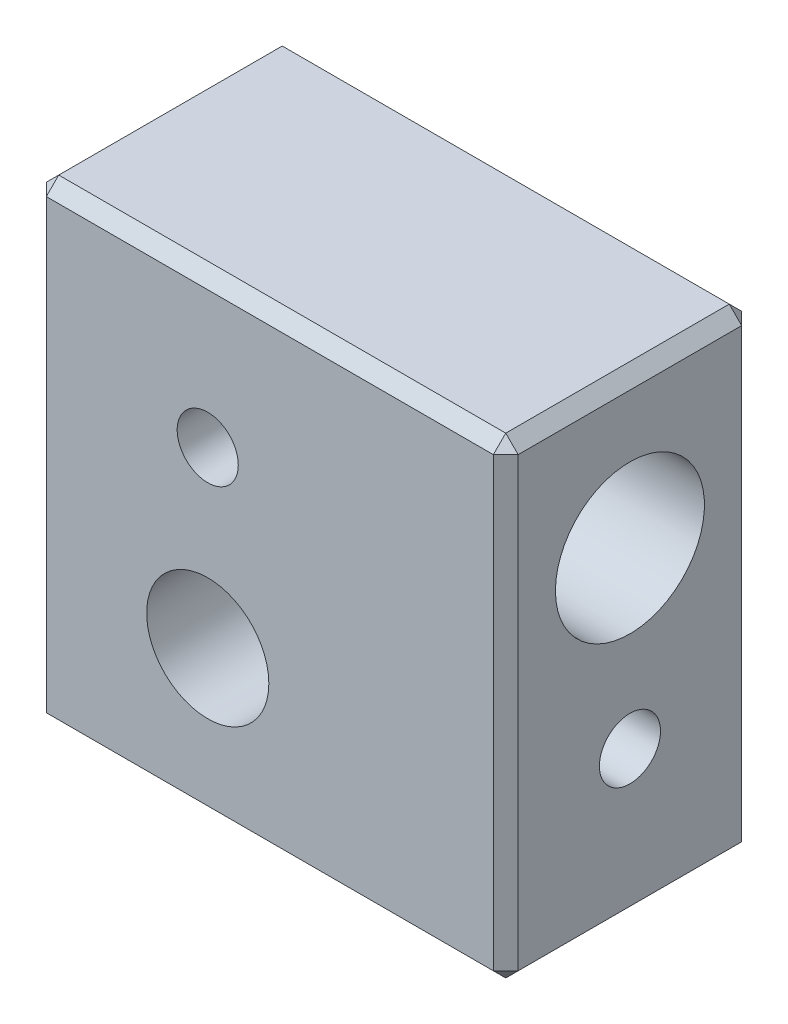
ISO-10303-21;
HEADER;
FILE_DESCRIPTION(('STEP AP214'),'2;1');
FILE_NAME('part.step','',(''),(''),'','','');
FILE_SCHEMA(('AUTOMOTIVE_DESIGN { 1 0 10303 214 1 1 1 1 }'));
ENDSEC;
DATA;
#1=APPLICATION_CONTEXT('core data for automotive mechanical design processes');
#2=APPLICATION_PROTOCOL_DEFINITION('international standard','automotive_design',2000,#1);
#3=PRODUCT_CONTEXT('',#1,'mechanical');
#4=PRODUCT('Part','Part','',(#3));
#5=PRODUCT_RELATED_PRODUCT_CATEGORY('part','',(#4));
#6=PRODUCT_DEFINITION_FORMATION('','',#4);
#7=PRODUCT_DEFINITION_CONTEXT('part definition',#1,'design');
#8=PRODUCT_DEFINITION('design','',#6,#7);
#9=PRODUCT_DEFINITION_SHAPE('','',#8);
#10=(LENGTH_UNIT() NAMED_UNIT(*) SI_UNIT(.MILLI.,.METRE.));
#11=(NAMED_UNIT(*) PLANE_ANGLE_UNIT() SI_UNIT($,.RADIAN.));
#12=(NAMED_UNIT(*) SI_UNIT($,.STERADIAN.) SOLID_ANGLE_UNIT());
#13=UNCERTAINTY_MEASURE_WITH_UNIT(LENGTH_MEASURE(1.E-05),#10,'distance_accuracy_value','');
#14=(GEOMETRIC_REPRESENTATION_CONTEXT(3) GLOBAL_UNCERTAINTY_ASSIGNED_CONTEXT((#13)) GLOBAL_UNIT_ASSIGNED_CONTEXT((#10,
#11,#12)) REPRESENTATION_CONTEXT('',''));
#15=CARTESIAN_POINT('',(0.,0.,0.));
#16=DIRECTION('',(0.,0.,1.));
#17=DIRECTION('',(1.,0.,0.));
#18=AXIS2_PLACEMENT_3D('',#15,#16,#17);
#19=CARTESIAN_POINT('',(-7.2166088223,-4.3152643177,133.88));
#20=DIRECTION('',(0.,0.707106781186548,-0.707106781186548));
#21=DIRECTION('',(0.,0.707106781186548,0.707106781186548));
#22=AXIS2_PLACEMENT_3D('',#19,#20,#21);
#23=PLANE('',#22);
#24=DIRECTION('',(0.,0.707106781186548,0.707106781186548));
#25=VECTOR('',#24,1.);
#26=CARTESIAN_POINT('',(11.2833911777,-4.3152643177,133.88));
#27=LINE('',#26,#25);
#28=CARTESIAN_POINT('',(11.2833911777,-4.0652643177,134.13));
#29=VERTEX_POINT('',#28);
#30=CARTESIAN_POINT('',(11.2833911777,-4.5652643177,133.63));
#31=VERTEX_POINT('',#30);
#32=EDGE_CURVE('E161',#29,#31,#27,.F.);
#33=ORIENTED_EDGE('',*,*,#32,.T.);
#34=DIRECTION('',(1.,0.,0.));
#35=VECTOR('',#34,1.);
#36=CARTESIAN_POINT('',(-7.2166088223,-4.5652643177,133.63));
#37=LINE('',#36,#35);
#38=CARTESIAN_POINT('',(-6.7166088223,-4.5652643177,133.63));
#39=VERTEX_POINT('',#38);
#40=EDGE_CURVE('E144',#31,#39,#37,.F.);
#41=ORIENTED_EDGE('',*,*,#40,.T.);
#42=DIRECTION('',(0.,-0.707106781186547,-0.707106781186548));
#43=VECTOR('',#42,1.);
#44=CARTESIAN_POINT('',(-6.7166088223,-4.0652643177,134.13));
#45=LINE('',#44,#43);
#46=CARTESIAN_POINT('',(-6.7166088223,-4.0652643177,134.13));
#47=VERTEX_POINT('',#46);
#48=EDGE_CURVE('E154',#47,#39,#45,.T.);
#49=ORIENTED_EDGE('',*,*,#48,.F.);
#50=DIRECTION('',(1.,0.,0.));
#51=VECTOR('',#50,1.);
#52=CARTESIAN_POINT('',(-7.2166088223,-4.0652643177,134.13));
#53=LINE('',#52,#51);
#54=EDGE_CURVE('E121',#47,#29,#53,.T.);
#55=ORIENTED_EDGE('',*,*,#54,.T.);
#56=EDGE_LOOP('',(#33,#41,#49,#55));
#57=FACE_BOUND('',#56,.T.);
#58=ADVANCED_FACE('F16',(#57),#23,.T.);
#59=CARTESIAN_POINT('',(-7.2166088223,-22.8152643177,133.88));
#60=DIRECTION('',(0.,0.707106781186548,0.707106781186548));
#61=DIRECTION('',(0.,-0.707106781186548,0.707106781186548));
#62=AXIS2_PLACEMENT_3D('',#59,#60,#61);
#63=PLANE('',#62);
#64=DIRECTION('',(1.,0.,0.));
#65=VECTOR('',#64,1.);
#66=CARTESIAN_POINT('',(-7.2166088223,-22.5652643177,133.63));
#67=LINE('',#66,#65);
#68=CARTESIAN_POINT('',(-6.7166088223,-22.5652643177,133.63));
#69=VERTEX_POINT('',#68);
#70=CARTESIAN_POINT('',(11.2833911777,-22.5652643177,133.63));
#71=VERTEX_POINT('',#70);
#72=EDGE_CURVE('E141',#69,#71,#67,.T.);
#73=ORIENTED_EDGE('',*,*,#72,.T.);
#74=DIRECTION('',(0.,-0.707106781186548,0.707106781186548));
#75=VECTOR('',#74,1.);
#76=CARTESIAN_POINT('',(11.2833911777,-22.8152643177,133.88));
#77=LINE('',#76,#75);
#78=CARTESIAN_POINT('',(11.2833911777,-23.0652643177,134.13));
#79=VERTEX_POINT('',#78);
#80=EDGE_CURVE('E159',#79,#71,#77,.F.);
#81=ORIENTED_EDGE('',*,*,#80,.F.);
#82=DIRECTION('',(1.,0.,0.));
#83=VECTOR('',#82,1.);
#84=CARTESIAN_POINT('',(-7.2166088223,-23.0652643177,134.13));
#85=LINE('',#84,#83);
#86=CARTESIAN_POINT('',(-6.7166088223,-23.0652643177,134.13));
#87=VERTEX_POINT('',#86);
#88=EDGE_CURVE('E150',#87,#79,#85,.T.);
#89=ORIENTED_EDGE('',*,*,#88,.F.);
#90=DIRECTION('',(0.,0.707106781186547,-0.707106781186547));
#91=VECTOR('',#90,1.);
#92=CARTESIAN_POINT('',(-6.7166088223,-23.0652643177,134.13));
#93=LINE('',#92,#91);
#94=EDGE_CURVE('E156',#87,#69,#93,.T.);
#95=ORIENTED_EDGE('',*,*,#94,.T.);
#96=EDGE_LOOP('',(#73,#81,#89,#95));
#97=FACE_BOUND('',#96,.T.);
#98=ADVANCED_FACE('F398',(#97),#63,.F.);
#99=CARTESIAN_POINT('',(-6.7166088223,-4.5652643177,143.63));
#100=DIRECTION('',(0.577350269189626,-0.577350269189626,-0.577350269189626));
#101=DIRECTION('',(-0.707106781186547,0.,-0.707106781186547));
#102=AXIS2_PLACEMENT_3D('',#99,#100,#101);
#103=PLANE('',#102);
#104=DIRECTION('',(-0.707106781186548,0.,-0.707106781186548));
#105=VECTOR('',#104,1.);
#106=CARTESIAN_POINT('',(-6.9666088223,-4.5652643177,143.38));
#107=LINE('',#106,#105);
#108=CARTESIAN_POINT('',(-7.2166088223,-4.5652643177,143.13));
#109=VERTEX_POINT('',#108);
#110=CARTESIAN_POINT('',(-6.7166088223,-4.5652643177,143.63));
#111=VERTEX_POINT('',#110);
#112=EDGE_CURVE('E139',#109,#111,#107,.F.);
#113=ORIENTED_EDGE('',*,*,#112,.T.);
#114=DIRECTION('',(0.,0.707106781186548,-0.707106781186548));
#115=VECTOR('',#114,1.);
#116=CARTESIAN_POINT('',(-6.7166088223,-4.3152643177,143.38));
#117=LINE('',#116,#115);
#118=CARTESIAN_POINT('',(-6.7166088223,-4.0652643177,143.13));
#119=VERTEX_POINT('',#118);
#120=EDGE_CURVE('E111',#111,#119,#117,.T.);
#121=ORIENTED_EDGE('',*,*,#120,.T.);
#122=DIRECTION('',(-0.707106781186548,-0.707106781186548,0.));
#123=VECTOR('',#122,1.);
#124=CARTESIAN_POINT('',(-6.9666088223,-4.3152643177,143.13));
#125=LINE('',#124,#123);
#126=EDGE_CURVE('E126',#109,#119,#125,.F.);
#127=ORIENTED_EDGE('',*,*,#126,.F.);
#128=EDGE_LOOP('',(#113,#121,#127));
#129=FACE_BOUND('',#128,.T.);
#130=ADVANCED_FACE('F138',(#129),#103,.F.);
#131=CARTESIAN_POINT('',(-6.7166088223,-22.5652643177,143.63));
#132=DIRECTION('',(0.577350269189626,0.577350269189626,-0.577350269189626));
#133=DIRECTION('',(-0.707106781186547,0.,-0.707106781186547));
#134=AXIS2_PLACEMENT_3D('',#131,#132,#133);
#135=PLANE('',#134);
#136=DIRECTION('',(0.,-0.707106781186548,-0.707106781186548));
#137=VECTOR('',#136,1.);
#138=CARTESIAN_POINT('',(-6.7166088223,-22.8152643177,143.38));
#139=LINE('',#138,#137);
#140=CARTESIAN_POINT('',(-6.7166088223,-22.5652643177,143.63));
#141=VERTEX_POINT('',#140);
#142=CARTESIAN_POINT('',(-6.7166088223,-23.0652643177,143.13));
#143=VERTEX_POINT('',#142);
#144=EDGE_CURVE('E259',#141,#143,#139,.T.);
#145=ORIENTED_EDGE('',*,*,#144,.F.);
#146=DIRECTION('',(-0.707106781186548,0.,-0.707106781186548));
#147=VECTOR('',#146,1.);
#148=CARTESIAN_POINT('',(-6.9666088223,-22.5652643177,143.38));
#149=LINE('',#148,#147);
#150=CARTESIAN_POINT('',(-7.2166088223,-22.5652643177,143.13));
#151=VERTEX_POINT('',#150);
#152=EDGE_CURVE('E125',#141,#151,#149,.T.);
#153=ORIENTED_EDGE('',*,*,#152,.T.);
#154=DIRECTION('',(-0.707106781186548,0.707106781186548,0.));
#155=VECTOR('',#154,1.);
#156=CARTESIAN_POINT('',(-6.9666088223,-22.8152643177,143.13));
#157=LINE('',#156,#155);
#158=EDGE_CURVE('E249',#151,#143,#157,.F.);
#159=ORIENTED_EDGE('',*,*,#158,.T.);
#160=EDGE_LOOP('',(#145,#153,#159));
#161=FACE_BOUND('',#160,.T.);
#162=ADVANCED_FACE('F286',(#161),#135,.F.);
#163=CARTESIAN_POINT('',(-6.7166088223,-23.0652643177,134.13));
#164=DIRECTION('',(0.577350269189626,0.577350269189626,0.577350269189626));
#165=DIRECTION('',(0.707106781186548,0.,-0.707106781186547));
#166=AXIS2_PLACEMENT_3D('',#163,#164,#165);
#167=PLANE('',#166);
#168=ORIENTED_EDGE('',*,*,#94,.F.);
#169=DIRECTION('',(-0.707106781186548,0.707106781186548,0.));
#170=VECTOR('',#169,1.);
#171=CARTESIAN_POINT('',(-6.9666088223,-22.8152643177,134.13));
#172=LINE('',#171,#170);
#173=CARTESIAN_POINT('',(-7.2166088223,-22.5652643177,134.13));
#174=VERTEX_POINT('',#173);
#175=EDGE_CURVE('E252',#87,#174,#172,.T.);
#176=ORIENTED_EDGE('',*,*,#175,.T.);
#177=DIRECTION('',(-0.707106781186548,0.,0.707106781186548));
#178=VECTOR('',#177,1.);
#179=CARTESIAN_POINT('',(-6.9666088223,-22.5652643177,133.88));
#180=LINE('',#179,#178);
#181=EDGE_CURVE('E241',#69,#174,#180,.T.);
#182=ORIENTED_EDGE('',*,*,#181,.F.);
#183=EDGE_LOOP('',(#168,#176,#182));
#184=FACE_BOUND('',#183,.T.);
#185=ADVANCED_FACE('F390',(#184),#167,.F.);
#186=CARTESIAN_POINT('',(-6.7166088223,-4.5652643177,133.63));
#187=DIRECTION('',(-0.577350269189626,0.577350269189626,-0.577350269189626));
#188=DIRECTION('',(-0.707106781186547,0.,0.707106781186547));
#189=AXIS2_PLACEMENT_3D('',#186,#187,#188);
#190=PLANE('',#189);
#191=DIRECTION('',(-0.707106781186548,0.,0.707106781186548));
#192=VECTOR('',#191,1.);
#193=CARTESIAN_POINT('',(-6.9666088223,-4.5652643177,133.88));
#194=LINE('',#193,#192);
#195=CARTESIAN_POINT('',(-7.2166088223,-4.5652643177,134.13));
#196=VERTEX_POINT('',#195);
#197=EDGE_CURVE('E238',#196,#39,#194,.F.);
#198=ORIENTED_EDGE('',*,*,#197,.F.);
#199=DIRECTION('',(-0.707106781186548,-0.707106781186548,0.));
#200=VECTOR('',#199,1.);
#201=CARTESIAN_POINT('',(-6.9666088223,-4.3152643177,134.13));
#202=LINE('',#201,#200);
#203=EDGE_CURVE('E136',#47,#196,#202,.T.);
#204=ORIENTED_EDGE('',*,*,#203,.F.);
#205=ORIENTED_EDGE('',*,*,#48,.T.);
#206=EDGE_LOOP('',(#198,#204,#205));
#207=FACE_BOUND('',#206,.T.);
#208=ADVANCED_FACE('F387',(#207),#190,.T.);
#209=CARTESIAN_POINT('',(-7.2166088223,-4.0652643177,133.63));
#210=DIRECTION('',(0.,-1.,0.));
#211=DIRECTION('',(1.,0.,0.));
#212=AXIS2_PLACEMENT_3D('',#209,#210,#211);
#213=PLANE('',#212);
#214=DIRECTION('',(0.,0.,1.));
#215=VECTOR('',#214,1.);
#216=CARTESIAN_POINT('',(11.2833911777,-4.0652643177,133.63));
#217=LINE('',#216,#215);
#218=CARTESIAN_POINT('',(11.2833911777,-4.0652643177,143.13));
#219=VERTEX_POINT('',#218);
#220=EDGE_CURVE('E232',#219,#29,#217,.F.);
#221=ORIENTED_EDGE('',*,*,#220,.T.);
#222=ORIENTED_EDGE('',*,*,#54,.F.);
#223=DIRECTION('',(0.,0.,1.));
#224=VECTOR('',#223,1.);
#225=CARTESIAN_POINT('',(-6.7166088223,-4.0652643177,133.63));
#226=LINE('',#225,#224);
#227=EDGE_CURVE('E117',#119,#47,#226,.F.);
#228=ORIENTED_EDGE('',*,*,#227,.F.);
#229=DIRECTION('',(1.,0.,0.));
#230=VECTOR('',#229,1.);
#231=CARTESIAN_POINT('',(-7.2166088223,-4.0652643177,143.13));
#232=LINE('',#231,#230);
#233=EDGE_CURVE('E107',#119,#219,#232,.T.);
#234=ORIENTED_EDGE('',*,*,#233,.T.);
#235=EDGE_LOOP('',(#221,#222,#228,#234));
#236=FACE_BOUND('',#235,.T.);
#237=ADVANCED_FACE('F119',(#236),#213,.F.);
#238=CARTESIAN_POINT('',(11.7833911777,-4.5652643177,143.13));
#239=DIRECTION('',(-0.577350269189626,-0.577350269189626,-0.577350269189626));
#240=DIRECTION('',(0.,0.707106781186547,-0.707106781186548));
#241=AXIS2_PLACEMENT_3D('',#238,#239,#240);
#242=PLANE('',#241);
#243=DIRECTION('',(0.707106781186548,0.,-0.707106781186548));
#244=VECTOR('',#243,1.);
#245=CARTESIAN_POINT('',(11.5333911777,-4.5652643177,143.38));
#246=LINE('',#245,#244);
#247=CARTESIAN_POINT('',(11.7833911777,-4.5652643177,143.13));
#248=VERTEX_POINT('',#247);
#249=CARTESIAN_POINT('',(11.2833911777,-4.5652643177,143.63));
#250=VERTEX_POINT('',#249);
#251=EDGE_CURVE('E230',#248,#250,#246,.F.);
#252=ORIENTED_EDGE('',*,*,#251,.F.);
#253=DIRECTION('',(0.707106781186548,-0.707106781186548,0.));
#254=VECTOR('',#253,1.);
#255=CARTESIAN_POINT('',(11.5333911777,-4.3152643177,143.13));
#256=LINE('',#255,#254);
#257=EDGE_CURVE('E234',#248,#219,#256,.F.);
#258=ORIENTED_EDGE('',*,*,#257,.T.);
#259=DIRECTION('',(0.,0.707106781186548,-0.707106781186548));
#260=VECTOR('',#259,1.);
#261=CARTESIAN_POINT('',(11.2833911777,-4.3152643177,143.38));
#262=LINE('',#261,#260);
#263=EDGE_CURVE('E104',#219,#250,#262,.F.);
#264=ORIENTED_EDGE('',*,*,#263,.T.);
#265=EDGE_LOOP('',(#252,#258,#264));
#266=FACE_BOUND('',#265,.T.);
#267=ADVANCED_FACE('F267',(#266),#242,.F.);
#268=CARTESIAN_POINT('',(11.2833911777,-23.0652643177,143.13));
#269=DIRECTION('',(0.577350269189626,-0.577350269189626,0.577350269189626));
#270=DIRECTION('',(0.707106781186547,0.,-0.707106781186548));
#271=AXIS2_PLACEMENT_3D('',#268,#269,#270);
#272=PLANE('',#271);
#273=DIRECTION('',(0.707106781186548,0.707106781186548,0.));
#274=VECTOR('',#273,1.);
#275=CARTESIAN_POINT('',(11.5333911777,-22.8152643177,143.13));
#276=LINE('',#275,#274);
#277=CARTESIAN_POINT('',(11.7833911777,-22.5652643177,143.13));
#278=VERTEX_POINT('',#277);
#279=CARTESIAN_POINT('',(11.2833911777,-23.0652643177,143.13));
#280=VERTEX_POINT('',#279);
#281=EDGE_CURVE('E224',#278,#280,#276,.F.);
#282=ORIENTED_EDGE('',*,*,#281,.F.);
#283=DIRECTION('',(0.707106781186548,0.,-0.707106781186548));
#284=VECTOR('',#283,1.);
#285=CARTESIAN_POINT('',(11.5333911777,-22.5652643177,143.38));
#286=LINE('',#285,#284);
#287=CARTESIAN_POINT('',(11.2833911777,-22.5652643177,143.63));
#288=VERTEX_POINT('',#287);
#289=EDGE_CURVE('E228',#288,#278,#286,.T.);
#290=ORIENTED_EDGE('',*,*,#289,.F.);
#291=DIRECTION('',(0.,-0.707106781186548,-0.707106781186548));
#292=VECTOR('',#291,1.);
#293=CARTESIAN_POINT('',(11.2833911777,-22.8152643177,143.38));
#294=LINE('',#293,#292);
#295=EDGE_CURVE('E261',#280,#288,#294,.F.);
#296=ORIENTED_EDGE('',*,*,#295,.F.);
#297=EDGE_LOOP('',(#282,#290,#296));
#298=FACE_BOUND('',#297,.T.);
#299=ADVANCED_FACE('F296',(#298),#272,.T.);
#300=CARTESIAN_POINT('',(-7.2166088223,-23.0652643177,133.63));
#301=DIRECTION('',(0.,-1.,0.));
#302=DIRECTION('',(1.,0.,0.));
#303=AXIS2_PLACEMENT_3D('',#300,#301,#302);
#304=PLANE('',#303);
#305=DIRECTION('',(0.,0.,1.));
#306=VECTOR('',#305,1.);
#307=CARTESIAN_POINT('',(11.2833911777,-23.0652643177,133.63));
#308=LINE('',#307,#306);
#309=EDGE_CURVE('E222',#280,#79,#308,.F.);
#310=ORIENTED_EDGE('',*,*,#309,.F.);
#311=DIRECTION('',(1.,0.,0.));
#312=VECTOR('',#311,1.);
#313=CARTESIAN_POINT('',(-7.2166088223,-23.0652643177,143.13));
#314=LINE('',#313,#312);
#315=EDGE_CURVE('E263',#143,#280,#314,.T.);
#316=ORIENTED_EDGE('',*,*,#315,.F.);
#317=DIRECTION('',(0.,0.,1.));
#318=VECTOR('',#317,1.);
#319=CARTESIAN_POINT('',(-6.7166088223,-23.0652643177,133.63));
#320=LINE('',#319,#318);
#321=EDGE_CURVE('E246',#143,#87,#320,.F.);
#322=ORIENTED_EDGE('',*,*,#321,.T.);
#323=ORIENTED_EDGE('',*,*,#88,.T.);
#324=EDGE_LOOP('',(#310,#316,#322,#323));
#325=FACE_BOUND('',#324,.T.);
#326=ADVANCED_FACE('F328',(#325),#304,.T.);
#327=CARTESIAN_POINT('',(-7.2166088223,-4.0652643177,133.63));
#328=DIRECTION('',(0.,0.,1.));
#329=DIRECTION('',(1.,0.,0.));
#330=AXIS2_PLACEMENT_3D('',#327,#328,#329);
#331=PLANE('',#330);
#332=CARTESIAN_POINT('',(-0.2166088223,-17.0652643177,133.63));
#333=DIRECTION('',(0.,0.,1.));
#334=DIRECTION('',(1.,0.,0.));
#335=AXIS2_PLACEMENT_3D('',#332,#333,#334);
#336=CIRCLE('',#335,2.46);
#337=CARTESIAN_POINT('',(2.2433911777,-17.0652643177,133.63));
#338=VERTEX_POINT('',#337);
#339=EDGE_CURVE('E19',#338,#338,#336,.T.);
#340=ORIENTED_EDGE('',*,*,#339,.T.);
#341=EDGE_LOOP('',(#340));
#342=FACE_BOUND('',#341,.T.);
#343=ORIENTED_EDGE('',*,*,#72,.F.);
#344=DIRECTION('',(0.,1.,0.));
#345=VECTOR('',#344,1.);
#346=CARTESIAN_POINT('',(-6.7166088223,-4.0652643177,133.63));
#347=LINE('',#346,#345);
#348=EDGE_CURVE('E243',#39,#69,#347,.F.);
#349=ORIENTED_EDGE('',*,*,#348,.F.);
#350=ORIENTED_EDGE('',*,*,#40,.F.);
#351=DIRECTION('',(0.,1.,0.));
#352=VECTOR('',#351,1.);
#353=CARTESIAN_POINT('',(11.2833911777,-4.0652643177,133.63));
#354=LINE('',#353,#352);
#355=EDGE_CURVE('E216',#31,#71,#354,.F.);
#356=ORIENTED_EDGE('',*,*,#355,.T.);
#357=EDGE_LOOP('',(#343,#349,#350,#356));
#358=FACE_BOUND('',#357,.T.);
#359=ADVANCED_FACE('F374',(#342,#358),#331,.F.);
#360=CARTESIAN_POINT('',(11.2833911777,-23.0652643177,134.13));
#361=DIRECTION('',(0.577350269189626,-0.577350269189626,-0.577350269189626));
#362=DIRECTION('',(-0.707106781186547,0.,-0.707106781186548));
#363=AXIS2_PLACEMENT_3D('',#360,#361,#362);
#364=PLANE('',#363);
#365=ORIENTED_EDGE('',*,*,#80,.T.);
#366=DIRECTION('',(0.707106781186548,0.,0.707106781186548));
#367=VECTOR('',#366,1.);
#368=CARTESIAN_POINT('',(11.5333911777,-22.5652643177,133.88));
#369=LINE('',#368,#367);
#370=CARTESIAN_POINT('',(11.7833911777,-22.5652643177,134.13));
#371=VERTEX_POINT('',#370);
#372=EDGE_CURVE('E211',#71,#371,#369,.T.);
#373=ORIENTED_EDGE('',*,*,#372,.T.);
#374=DIRECTION('',(0.707106781186548,0.707106781186548,0.));
#375=VECTOR('',#374,1.);
#376=CARTESIAN_POINT('',(11.5333911777,-22.8152643177,134.13));
#377=LINE('',#376,#375);
#378=EDGE_CURVE('E34',#79,#371,#377,.T.);
#379=ORIENTED_EDGE('',*,*,#378,.F.);
#380=EDGE_LOOP('',(#365,#373,#379));
#381=FACE_BOUND('',#380,.T.);
#382=ADVANCED_FACE('F371',(#381),#364,.T.);
#383=CARTESIAN_POINT('',(11.2833911777,-4.5652643177,133.63));
#384=DIRECTION('',(-0.577350269189626,-0.577350269189626,0.577350269189626));
#385=DIRECTION('',(0.707106781186547,0.,0.707106781186547));
#386=AXIS2_PLACEMENT_3D('',#383,#384,#385);
#387=PLANE('',#386);
#388=DIRECTION('',(0.707106781186548,0.,0.707106781186548));
#389=VECTOR('',#388,1.);
#390=CARTESIAN_POINT('',(11.5333911777,-4.5652643177,133.88));
#391=LINE('',#390,#389);
#392=CARTESIAN_POINT('',(11.7833911777,-4.5652643177,134.13));
#393=VERTEX_POINT('',#392);
#394=EDGE_CURVE('E205',#393,#31,#391,.F.);
#395=ORIENTED_EDGE('',*,*,#394,.T.);
#396=ORIENTED_EDGE('',*,*,#32,.F.);
#397=DIRECTION('',(0.707106781186548,-0.707106781186548,0.));
#398=VECTOR('',#397,1.);
#399=CARTESIAN_POINT('',(11.5333911777,-4.3152643177,134.13));
#400=LINE('',#399,#398);
#401=EDGE_CURVE('E236',#29,#393,#400,.T.);
#402=ORIENTED_EDGE('',*,*,#401,.T.);
#403=EDGE_LOOP('',(#395,#396,#402));
#404=FACE_BOUND('',#403,.T.);
#405=ADVANCED_FACE('F368',(#404),#387,.F.);
#406=CARTESIAN_POINT('',(4.7833911777,-15.8352643177,138.63));
#407=DIRECTION('',(-1.,0.,0.));
#408=DIRECTION('',(0.,0.,1.));
#409=AXIS2_PLACEMENT_3D('',#406,#407,#408);
#410=PLANE('',#409);
#411=CARTESIAN_POINT('',(4.7833911777,-17.0652643177,138.63));
#412=DIRECTION('',(1.,0.,0.));
#413=DIRECTION('',(0.,0.,-1.));
#414=AXIS2_PLACEMENT_3D('',#411,#412,#413);
#415=CIRCLE('',#414,1.23);
#416=CARTESIAN_POINT('',(4.7833911777,-17.0652643177,137.4));
#417=VERTEX_POINT('',#416);
#418=EDGE_CURVE('E202',#417,#417,#415,.T.);
#419=ORIENTED_EDGE('',*,*,#418,.T.);
#420=EDGE_LOOP('',(#419));
#421=FACE_BOUND('',#420,.T.);
#422=ADVANCED_FACE('F365',(#421),#410,.F.);
#423=CARTESIAN_POINT('',(-7.2166088223,-4.3152643177,143.38));
#424=DIRECTION('',(0.,-0.707106781186548,-0.707106781186548));
#425=DIRECTION('',(0.,0.707106781186548,-0.707106781186548));
#426=AXIS2_PLACEMENT_3D('',#423,#424,#425);
#427=PLANE('',#426);
#428=ORIENTED_EDGE('',*,*,#263,.F.);
#429=ORIENTED_EDGE('',*,*,#233,.F.);
#430=ORIENTED_EDGE('',*,*,#120,.F.);
#431=DIRECTION('',(1.,0.,0.));
#432=VECTOR('',#431,1.);
#433=CARTESIAN_POINT('',(-7.2166088223,-4.5652643177,143.63));
#434=LINE('',#433,#432);
#435=EDGE_CURVE('E204',#250,#111,#434,.F.);
#436=ORIENTED_EDGE('',*,*,#435,.F.);
#437=EDGE_LOOP('',(#428,#429,#430,#436));
#438=FACE_BOUND('',#437,.T.);
#439=ADVANCED_FACE('F109',(#438),#427,.F.);
#440=CARTESIAN_POINT('',(-7.2166088223,-22.8152643177,143.38));
#441=DIRECTION('',(0.,-0.707106781186548,0.707106781186548));
#442=DIRECTION('',(0.,-0.707106781186548,-0.707106781186548));
#443=AXIS2_PLACEMENT_3D('',#440,#441,#442);
#444=PLANE('',#443);
#445=DIRECTION('',(1.,0.,0.));
#446=VECTOR('',#445,1.);
#447=CARTESIAN_POINT('',(-7.2166088223,-22.5652643177,143.63));
#448=LINE('',#447,#446);
#449=EDGE_CURVE('E276',#141,#288,#448,.T.);
#450=ORIENTED_EDGE('',*,*,#449,.F.);
#451=ORIENTED_EDGE('',*,*,#144,.T.);
#452=ORIENTED_EDGE('',*,*,#315,.T.);
#453=ORIENTED_EDGE('',*,*,#295,.T.);
#454=EDGE_LOOP('',(#450,#451,#452,#453));
#455=FACE_BOUND('',#454,.T.);
#456=ADVANCED_FACE('F290',(#455),#444,.T.);
#457=CARTESIAN_POINT('',(-0.2166088223,-17.0652643177,143.63));
#458=DIRECTION('',(0.,0.,1.));
#459=DIRECTION('',(1.,0.,0.));
#460=AXIS2_PLACEMENT_3D('',#457,#458,#459);
#461=CYLINDRICAL_SURFACE('',#460,2.46);
#462=ORIENTED_EDGE('',*,*,#339,.F.);
#463=EDGE_LOOP('',(#462));
#464=FACE_BOUND('',#463,.T.);
#465=CARTESIAN_POINT('',(-0.2166088223,-17.0652643177,143.63));
#466=DIRECTION('',(0.,0.,1.));
#467=DIRECTION('',(1.,0.,0.));
#468=AXIS2_PLACEMENT_3D('',#465,#466,#467);
#469=CIRCLE('',#468,2.46);
#470=CARTESIAN_POINT('',(2.2433911777,-17.0652643177,143.63));
#471=VERTEX_POINT('',#470);
#472=EDGE_CURVE('E199',#471,#471,#469,.F.);
#473=ORIENTED_EDGE('',*,*,#472,.F.);
#474=EDGE_LOOP('',(#473));
#475=FACE_BOUND('',#474,.T.);
#476=ADVANCED_FACE('F357',(#464,#475),#461,.F.);
#477=CARTESIAN_POINT('',(-6.9666088223,-4.3152643177,133.63));
#478=DIRECTION('',(-0.707106781186548,0.707106781186548,0.));
#479=DIRECTION('',(-0.707106781186548,-0.707106781186548,0.));
#480=AXIS2_PLACEMENT_3D('',#477,#478,#479);
#481=PLANE('',#480);
#482=ORIENTED_EDGE('',*,*,#126,.T.);
#483=ORIENTED_EDGE('',*,*,#227,.T.);
#484=ORIENTED_EDGE('',*,*,#203,.T.);
#485=DIRECTION('',(0.,0.,1.));
#486=VECTOR('',#485,1.);
#487=CARTESIAN_POINT('',(-7.2166088223,-4.5652643177,133.63));
#488=LINE('',#487,#486);
#489=EDGE_CURVE('E132',#196,#109,#488,.T.);
#490=ORIENTED_EDGE('',*,*,#489,.T.);
#491=EDGE_LOOP('',(#482,#483,#484,#490));
#492=FACE_BOUND('',#491,.T.);
#493=ADVANCED_FACE('F130',(#492),#481,.T.);
#494=CARTESIAN_POINT('',(-6.9666088223,-4.0652643177,143.38));
#495=DIRECTION('',(0.707106781186548,0.,-0.707106781186548));
#496=DIRECTION('',(-0.707106781186548,0.,-0.707106781186548));
#497=AXIS2_PLACEMENT_3D('',#494,#495,#496);
#498=PLANE('',#497);
#499=DIRECTION('',(0.,1.,0.));
#500=VECTOR('',#499,1.);
#501=CARTESIAN_POINT('',(-7.2166088223,-4.0652643177,143.13));
#502=LINE('',#501,#500);
#503=EDGE_CURVE('E316',#109,#151,#502,.F.);
#504=ORIENTED_EDGE('',*,*,#503,.T.);
#505=ORIENTED_EDGE('',*,*,#152,.F.);
#506=DIRECTION('',(0.,1.,0.));
#507=VECTOR('',#506,1.);
#508=CARTESIAN_POINT('',(-6.7166088223,-4.0652643177,143.63));
#509=LINE('',#508,#507);
#510=EDGE_CURVE('E208',#111,#141,#509,.F.);
#511=ORIENTED_EDGE('',*,*,#510,.F.);
#512=ORIENTED_EDGE('',*,*,#112,.F.);
#513=EDGE_LOOP('',(#504,#505,#511,#512));
#514=FACE_BOUND('',#513,.T.);
#515=ADVANCED_FACE('F318',(#514),#498,.F.);
#516=CARTESIAN_POINT('',(-6.9666088223,-22.8152643177,133.63));
#517=DIRECTION('',(0.707106781186548,0.707106781186548,0.));
#518=DIRECTION('',(-0.707106781186548,0.707106781186548,0.));
#519=AXIS2_PLACEMENT_3D('',#516,#517,#518);
#520=PLANE('',#519);
#521=ORIENTED_EDGE('',*,*,#158,.F.);
#522=DIRECTION('',(0.,0.,1.));
#523=VECTOR('',#522,1.);
#524=CARTESIAN_POINT('',(-7.2166088223,-22.5652643177,133.63));
#525=LINE('',#524,#523);
#526=EDGE_CURVE('E314',#151,#174,#525,.F.);
#527=ORIENTED_EDGE('',*,*,#526,.T.);
#528=ORIENTED_EDGE('',*,*,#175,.F.);
#529=ORIENTED_EDGE('',*,*,#321,.F.);
#530=EDGE_LOOP('',(#521,#527,#528,#529));
#531=FACE_BOUND('',#530,.T.);
#532=ADVANCED_FACE('F325',(#531),#520,.F.);
#533=CARTESIAN_POINT('',(-6.9666088223,-4.0652643177,133.88));
#534=DIRECTION('',(-0.707106781186548,0.,-0.707106781186548));
#535=DIRECTION('',(-0.707106781186548,0.,0.707106781186548));
#536=AXIS2_PLACEMENT_3D('',#533,#534,#535);
#537=PLANE('',#536);
#538=DIRECTION('',(0.,1.,0.));
#539=VECTOR('',#538,1.);
#540=CARTESIAN_POINT('',(-7.2166088223,-4.0652643177,134.13));
#541=LINE('',#540,#539);
#542=EDGE_CURVE('E308',#174,#196,#541,.T.);
#543=ORIENTED_EDGE('',*,*,#542,.T.);
#544=ORIENTED_EDGE('',*,*,#197,.T.);
#545=ORIENTED_EDGE('',*,*,#348,.T.);
#546=ORIENTED_EDGE('',*,*,#181,.T.);
#547=EDGE_LOOP('',(#543,#544,#545,#546));
#548=FACE_BOUND('',#547,.T.);
#549=ADVANCED_FACE('F346',(#548),#537,.T.);
#550=CARTESIAN_POINT('',(11.5333911777,-4.3152643177,133.63));
#551=DIRECTION('',(-0.707106781186548,-0.707106781186548,0.));
#552=DIRECTION('',(0.707106781186548,-0.707106781186548,0.));
#553=AXIS2_PLACEMENT_3D('',#550,#551,#552);
#554=PLANE('',#553);
#555=ORIENTED_EDGE('',*,*,#257,.F.);
#556=DIRECTION('',(0.,0.,1.));
#557=VECTOR('',#556,1.);
#558=CARTESIAN_POINT('',(11.7833911777,-4.5652643177,133.63));
#559=LINE('',#558,#557);
#560=EDGE_CURVE('E305',#393,#248,#559,.T.);
#561=ORIENTED_EDGE('',*,*,#560,.F.);
#562=ORIENTED_EDGE('',*,*,#401,.F.);
#563=ORIENTED_EDGE('',*,*,#220,.F.);
#564=EDGE_LOOP('',(#555,#561,#562,#563));
#565=FACE_BOUND('',#564,.T.);
#566=ADVANCED_FACE('F340',(#565),#554,.F.);
#567=CARTESIAN_POINT('',(11.5333911777,-4.0652643177,143.38));
#568=DIRECTION('',(0.707106781186548,0.,0.707106781186548));
#569=DIRECTION('',(0.707106781186548,0.,-0.707106781186548));
#570=AXIS2_PLACEMENT_3D('',#567,#568,#569);
#571=PLANE('',#570);
#572=ORIENTED_EDGE('',*,*,#289,.T.);
#573=DIRECTION('',(0.,1.,0.));
#574=VECTOR('',#573,1.);
#575=CARTESIAN_POINT('',(11.7833911777,-4.0652643177,143.13));
#576=LINE('',#575,#574);
#577=EDGE_CURVE('E299',#248,#278,#576,.F.);
#578=ORIENTED_EDGE('',*,*,#577,.F.);
#579=ORIENTED_EDGE('',*,*,#251,.T.);
#580=DIRECTION('',(0.,1.,0.));
#581=VECTOR('',#580,1.);
#582=CARTESIAN_POINT('',(11.2833911777,-4.0652643177,143.63));
#583=LINE('',#582,#581);
#584=EDGE_CURVE('E201',#288,#250,#583,.T.);
#585=ORIENTED_EDGE('',*,*,#584,.F.);
#586=EDGE_LOOP('',(#572,#578,#579,#585));
#587=FACE_BOUND('',#586,.T.);
#588=ADVANCED_FACE('F298',(#587),#571,.T.);
#589=CARTESIAN_POINT('',(11.5333911777,-22.8152643177,133.63));
#590=DIRECTION('',(0.707106781186548,-0.707106781186548,0.));
#591=DIRECTION('',(0.707106781186548,0.707106781186548,0.));
#592=AXIS2_PLACEMENT_3D('',#589,#590,#591);
#593=PLANE('',#592);
#594=ORIENTED_EDGE('',*,*,#281,.T.);
#595=ORIENTED_EDGE('',*,*,#309,.T.);
#596=ORIENTED_EDGE('',*,*,#378,.T.);
#597=DIRECTION('',(0.,0.,1.));
#598=VECTOR('',#597,1.);
#599=CARTESIAN_POINT('',(11.7833911777,-22.5652643177,133.63));
#600=LINE('',#599,#598);
#601=EDGE_CURVE('E303',#278,#371,#600,.F.);
#602=ORIENTED_EDGE('',*,*,#601,.F.);
#603=EDGE_LOOP('',(#594,#595,#596,#602));
#604=FACE_BOUND('',#603,.T.);
#605=ADVANCED_FACE('F329',(#604),#593,.T.);
#606=CARTESIAN_POINT('',(11.5333911777,-4.0652643177,133.88));
#607=DIRECTION('',(-0.707106781186548,0.,0.707106781186548));
#608=DIRECTION('',(0.707106781186548,0.,0.707106781186548));
#609=AXIS2_PLACEMENT_3D('',#606,#607,#608);
#610=PLANE('',#609);
#611=DIRECTION('',(0.,1.,0.));
#612=VECTOR('',#611,1.);
#613=CARTESIAN_POINT('',(11.7833911777,-4.0652643177,134.13));
#614=LINE('',#613,#612);
#615=EDGE_CURVE('E198',#371,#393,#614,.T.);
#616=ORIENTED_EDGE('',*,*,#615,.F.);
#617=ORIENTED_EDGE('',*,*,#372,.F.);
#618=ORIENTED_EDGE('',*,*,#355,.F.);
#619=ORIENTED_EDGE('',*,*,#394,.F.);
#620=EDGE_LOOP('',(#616,#617,#618,#619));
#621=FACE_BOUND('',#620,.T.);
#622=ADVANCED_FACE('F331',(#621),#610,.F.);
#623=CARTESIAN_POINT('',(11.7833911777,-17.0652643177,138.63));
#624=DIRECTION('',(1.,0.,0.));
#625=DIRECTION('',(0.,0.,-1.));
#626=AXIS2_PLACEMENT_3D('',#623,#624,#625);
#627=CYLINDRICAL_SURFACE('',#626,1.23);
#628=ORIENTED_EDGE('',*,*,#418,.F.);
#629=EDGE_LOOP('',(#628));
#630=FACE_BOUND('',#629,.T.);
#631=CARTESIAN_POINT('',(11.7833911777,-17.0652643177,138.63));
#632=DIRECTION('',(1.,0.,0.));
#633=DIRECTION('',(0.,0.,-1.));
#634=AXIS2_PLACEMENT_3D('',#631,#632,#633);
#635=CIRCLE('',#634,1.23);
#636=CARTESIAN_POINT('',(11.7833911777,-17.0652643177,137.4));
#637=VERTEX_POINT('',#636);
#638=EDGE_CURVE('E193',#637,#637,#635,.F.);
#639=ORIENTED_EDGE('',*,*,#638,.F.);
#640=EDGE_LOOP('',(#639));
#641=FACE_BOUND('',#640,.T.);
#642=ADVANCED_FACE('F337',(#630,#641),#627,.F.);
#643=CARTESIAN_POINT('',(-7.2166088223,-4.0652643177,143.63));
#644=DIRECTION('',(0.,0.,1.));
#645=DIRECTION('',(1.,0.,0.));
#646=AXIS2_PLACEMENT_3D('',#643,#644,#645);
#647=PLANE('',#646);
#648=CARTESIAN_POINT('',(-0.2166088223,-10.0652643177,143.63));
#649=DIRECTION('',(0.,0.,1.));
#650=DIRECTION('',(1.,0.,0.));
#651=AXIS2_PLACEMENT_3D('',#648,#649,#650);
#652=CIRCLE('',#651,1.23);
#653=CARTESIAN_POINT('',(1.0133911777,-10.0652643177,143.63));
#654=VERTEX_POINT('',#653);
#655=EDGE_CURVE('E190',#654,#654,#652,.F.);
#656=ORIENTED_EDGE('',*,*,#655,.T.);
#657=EDGE_LOOP('',(#656));
#658=FACE_BOUND('',#657,.T.);
#659=ORIENTED_EDGE('',*,*,#472,.T.);
#660=EDGE_LOOP('',(#659));
#661=FACE_BOUND('',#660,.T.);
#662=ORIENTED_EDGE('',*,*,#449,.T.);
#663=ORIENTED_EDGE('',*,*,#584,.T.);
#664=ORIENTED_EDGE('',*,*,#435,.T.);
#665=ORIENTED_EDGE('',*,*,#510,.T.);
#666=EDGE_LOOP('',(#662,#663,#664,#665));
#667=FACE_BOUND('',#666,.T.);
#668=ADVANCED_FACE('F273',(#658,#661,#667),#647,.T.);
#669=CARTESIAN_POINT('',(-7.2166088223,-4.0652643177,133.63));
#670=DIRECTION('',(1.,0.,0.));
#671=DIRECTION('',(0.,1.,0.));
#672=AXIS2_PLACEMENT_3D('',#669,#670,#671);
#673=PLANE('',#672);
#674=CARTESIAN_POINT('',(-7.2166088223,-10.0652643177,138.63));
#675=DIRECTION('',(-1.,0.,0.));
#676=DIRECTION('',(0.,0.,1.));
#677=AXIS2_PLACEMENT_3D('',#674,#675,#676);
#678=CIRCLE('',#677,3.);
#679=CARTESIAN_POINT('',(-7.2166088223,-10.0652643177,141.63));
#680=VERTEX_POINT('',#679);
#681=EDGE_CURVE('E184',#680,#680,#678,.F.);
#682=ORIENTED_EDGE('',*,*,#681,.T.);
#683=EDGE_LOOP('',(#682));
#684=FACE_BOUND('',#683,.T.);
#685=ORIENTED_EDGE('',*,*,#526,.F.);
#686=ORIENTED_EDGE('',*,*,#503,.F.);
#687=ORIENTED_EDGE('',*,*,#489,.F.);
#688=ORIENTED_EDGE('',*,*,#542,.F.);
#689=EDGE_LOOP('',(#685,#686,#687,#688));
#690=FACE_BOUND('',#689,.T.);
#691=ADVANCED_FACE('F320',(#684,#690),#673,.F.);
#692=CARTESIAN_POINT('',(11.7833911777,-4.0652643177,133.63));
#693=DIRECTION('',(1.,0.,0.));
#694=DIRECTION('',(0.,1.,0.));
#695=AXIS2_PLACEMENT_3D('',#692,#693,#694);
#696=PLANE('',#695);
#697=ORIENTED_EDGE('',*,*,#638,.T.);
#698=EDGE_LOOP('',(#697));
#699=FACE_BOUND('',#698,.T.);
#700=CARTESIAN_POINT('',(11.7833911777,-10.0652643177,138.63));
#701=DIRECTION('',(-1.,0.,0.));
#702=DIRECTION('',(0.,0.,1.));
#703=AXIS2_PLACEMENT_3D('',#700,#701,#702);
#704=CIRCLE('',#703,3.);
#705=CARTESIAN_POINT('',(11.7833911777,-10.0652643177,141.63));
#706=VERTEX_POINT('',#705);
#707=EDGE_CURVE('E25',#706,#706,#704,.T.);
#708=ORIENTED_EDGE('',*,*,#707,.T.);
#709=EDGE_LOOP('',(#708));
#710=FACE_BOUND('',#709,.T.);
#711=ORIENTED_EDGE('',*,*,#601,.T.);
#712=ORIENTED_EDGE('',*,*,#615,.T.);
#713=ORIENTED_EDGE('',*,*,#560,.T.);
#714=ORIENTED_EDGE('',*,*,#577,.T.);
#715=EDGE_LOOP('',(#711,#712,#713,#714));
#716=FACE_BOUND('',#715,.T.);
#717=ADVANCED_FACE('F179',(#699,#710,#716),#696,.T.);
#718=CARTESIAN_POINT('',(-0.2166088223,-10.0652643177,143.63));
#719=DIRECTION('',(0.,0.,1.));
#720=DIRECTION('',(1.,0.,0.));
#721=AXIS2_PLACEMENT_3D('',#718,#719,#720);
#722=CYLINDRICAL_SURFACE('',#721,1.23);
#723=CARTESIAN_POINT('',(-0.2166088223,-11.2952643177,141.366256566918));
#724=CARTESIAN_POINT('',(-0.282320481907863,-11.295257454774,141.366263120625));
#725=CARTESIAN_POINT('',(-0.348143711029961,-11.2899651233013,141.368658068947));
#726=CARTESIAN_POINT('',(-0.4778969538742,-11.2689972011316,141.37793557094));
#727=CARTESIAN_POINT('',(-0.541821244145725,-11.2532930078161,141.384830485735));
#728=CARTESIAN_POINT('',(-0.665668204025764,-11.2122095581202,141.402184692714));
#729=CARTESIAN_POINT('',(-0.725605727982075,-11.1868688903176,141.412629751108));
#730=CARTESIAN_POINT('',(-0.840360629423591,-11.1273447845721,141.435887015916));
#731=CARTESIAN_POINT('',(-0.895179326536559,-11.0931636343094,141.448698609688));
#732=CARTESIAN_POINT('',(-1.00147542621801,-11.0147279035956,141.476108575472));
#733=CARTESIAN_POINT('',(-1.05260708683773,-10.9700252922298,141.490766307338));
#734=CARTESIAN_POINT('',(-1.14690251865473,-10.872757036478,141.519728218214));
#735=CARTESIAN_POINT('',(-1.19006327407486,-10.8201884295686,141.534032261642));
#736=CARTESIAN_POINT('',(-1.26893490050412,-10.7059838003815,141.56139268103));
#737=CARTESIAN_POINT('',(-1.30425936305161,-10.6440607829965,141.574372002242));
#738=CARTESIAN_POINT('',(-1.36384121524177,-10.5145234334112,141.596897043507));
#739=CARTESIAN_POINT('',(-1.38810337004782,-10.4469115666161,141.606444241595));
#740=CARTESIAN_POINT('',(-1.42362684385129,-10.3115431398125,141.620608744558));
#741=CARTESIAN_POINT('',(-1.43548366267872,-10.2439668645442,141.625450974093));
#742=CARTESIAN_POINT('',(-1.44778140527458,-10.1076220040716,141.630475341219));
#743=CARTESIAN_POINT('',(-1.44822680484742,-10.0388538969202,141.630659305882));
#744=CARTESIAN_POINT('',(-1.43800694689236,-9.9063971548104,141.626480639889));
#745=CARTESIAN_POINT('',(-1.42799524708175,-9.8426480974251,141.622385445863));
#746=CARTESIAN_POINT('',(-1.39826221183914,-9.71782751652129,141.610473128838));
#747=CARTESIAN_POINT('',(-1.37854016192429,-9.6567561903891,141.602655731962));
#748=CARTESIAN_POINT('',(-1.32970820782142,-9.53791124050511,141.583908596243));
#749=CARTESIAN_POINT('',(-1.30046017258495,-9.48020184720101,141.572933358469));
#750=CARTESIAN_POINT('',(-1.23353935441049,-9.37035980230258,141.548950683246));
#751=CARTESIAN_POINT('',(-1.19586362724386,-9.318229109069,141.535942536077));
#752=CARTESIAN_POINT('',(-1.11015066277838,-9.21722839312374,141.50815292098));
#753=CARTESIAN_POINT('',(-1.06158018474151,-9.16882685949552,141.493311018535));
#754=CARTESIAN_POINT('',(-0.956968225277115,-9.08065781958993,141.46420367116));
#755=CARTESIAN_POINT('',(-0.900924053471319,-9.0408934361262,141.449938436239));
#756=CARTESIAN_POINT('',(-0.780756651344355,-8.96997854676619,141.42317632112));
#757=CARTESIAN_POINT('',(-0.716437011676656,-8.93913284452982,141.410747863436));
#758=CARTESIAN_POINT('',(-0.582871102011234,-8.88889990372581,141.389875990778));
#759=CARTESIAN_POINT('',(-0.513628261065891,-8.86950477565517,141.381429832789));
#760=CARTESIAN_POINT('',(-0.376868227623531,-8.84389400183084,141.370153168714));
#761=CARTESIAN_POINT('',(-0.309519854263553,-8.83692088953776,141.367000644896));
#762=CARTESIAN_POINT('',(-0.174556111177404,-8.83413352694318,141.365748807163));
#763=CARTESIAN_POINT('',(-0.106940836323342,-8.83831561543218,141.367647835296));
#764=CARTESIAN_POINT('',(0.0222866825558796,-8.8570292915885,141.375953309543));
#765=CARTESIAN_POINT('',(0.0840132405117536,-8.8709126757567,141.382077159746));
#766=CARTESIAN_POINT('',(0.204214032872757,-8.90778322084407,141.39778540846));
#767=CARTESIAN_POINT('',(0.262687519483834,-8.93077246517598,141.407370598877));
#768=CARTESIAN_POINT('',(0.377442260096886,-8.9862674810686,141.429408846766));
#769=CARTESIAN_POINT('',(0.433530707951691,-9.01912980531641,141.441964742117));
#770=CARTESIAN_POINT('',(0.539660945182846,-9.09307950696606,141.468379239301));
#771=CARTESIAN_POINT('',(0.589700163926506,-9.13417036153276,141.482238390538));
#772=CARTESIAN_POINT('',(0.686389115140621,-9.22720731310796,141.511008306103));
#773=CARTESIAN_POINT('',(0.732466256122361,-9.27975161336716,141.525916401957));
#774=CARTESIAN_POINT('',(0.815246362159496,-9.39217656490608,141.554090875191));
#775=CARTESIAN_POINT('',(0.851948767857436,-9.45205765363087,141.567357154584));
#776=CARTESIAN_POINT('',(0.914856664168555,-9.57779007280036,141.590820659777));
#777=CARTESIAN_POINT('',(0.941047670776643,-9.6436494889014,141.601013646009));
#778=CARTESIAN_POINT('',(0.981795154446975,-9.7793630192229,141.617125404377));
#779=CARTESIAN_POINT('',(0.996358311487597,-9.84921481514396,141.623046630369));
#780=CARTESIAN_POINT('',(1.01261496115568,-9.98580299838069,141.629673613194));
#781=CARTESIAN_POINT('',(1.01511666674908,-10.0524279948587,141.630706810593));
#782=CARTESIAN_POINT('',(1.00933667437833,-10.1851208561311,141.628338669676));
#783=CARTESIAN_POINT('',(1.00105676255432,-10.251188811383,141.624938065886));
#784=CARTESIAN_POINT('',(0.974528140136627,-10.3786142749946,141.614253295838));
#785=CARTESIAN_POINT('',(0.95662289902928,-10.4400554445376,141.607103132217));
#786=CARTESIAN_POINT('',(0.911720918473715,-10.5590437620112,141.589696103445));
#787=CARTESIAN_POINT('',(0.884722424435119,-10.6165901558489,141.579438638764));
#788=CARTESIAN_POINT('',(0.821041865823507,-10.7289958390191,141.556243629911));
#789=CARTESIAN_POINT('',(0.783979761704239,-10.7836188131671,141.543206507726));
#790=CARTESIAN_POINT('',(0.70178479473374,-10.8861002959448,141.516008326146));
#791=CARTESIAN_POINT('',(0.656649055947761,-10.9339563832083,141.501846867249));
#792=CARTESIAN_POINT('',(0.556096968062079,-11.0248014368415,141.472834871492));
#793=CARTESIAN_POINT('',(0.500200877380213,-11.0672662789307,141.457999957613));
#794=CARTESIAN_POINT('',(0.381602179064052,-11.1422814890405,141.430292808986));
#795=CARTESIAN_POINT('',(0.318895857972944,-11.1748264107763,141.417421654319));
#796=CARTESIAN_POINT('',(0.188746239281287,-11.2286701466731,141.395380953365));
#797=CARTESIAN_POINT('',(0.121340217390731,-11.2500480904504,141.386185473384));
#798=CARTESIAN_POINT('',(-0.0164787971285406,-11.280911985863,141.37271703617));
#799=CARTESIAN_POINT('',(-0.0868808733957282,-11.2904378295946,141.368427570111));
#800=CARTESIAN_POINT('',(-0.177188934079494,-11.2947926727629,141.366467621922));
#801=CARTESIAN_POINT('',(-0.196893856814041,-11.2952663767311,141.366254600659));
#802=CARTESIAN_POINT('',(-0.2166088223,-11.2952643177,141.366256566918));
#803=B_SPLINE_CURVE_WITH_KNOTS('',3,(#723,#724,#725,#726,#727,#728,#729,#730,#731,#732,#733,
#734,#735,#736,#737,#738,#739,#740,#741,#742,#743,#744,#745,#746,#747,#748,#749,#750,#751,#752,
#753,#754,#755,#756,#757,#758,#759,#760,#761,#762,#763,#764,#765,#766,#767,#768,#769,#770,#771,
#772,#773,#774,#775,#776,#777,#778,#779,#780,#781,#782,#783,#784,#785,#786,#787,#788,#789,#790,
#791,#792,#793,#794,#795,#796,#797,#798,#799,#800,#801,#802),.UNSPECIFIED.,.T.,.F.,(4,2,2,2,2,2,
2,2,2,2,2,2,2,2,2,2,2,2,2,2,2,2,2,2,2,2,2,2,2,2,2,2,2,2,2,2,2,2,2,4),(0.,0.197079969259986,
0.394703596347647,0.591544047804959,0.788333613102367,0.995865440288801,1.20347562661136,
1.41975624064667,1.63594360213288,1.8411964465316,2.04636878511145,2.23944375982115,
2.43253294301723,2.62855691143186,2.82464946840545,3.03418422005566,3.24379460461546,
3.45989458326475,3.67584549365197,3.87810819346031,4.08030451750327,4.27014224342888,
4.4600234291711,4.65781489710262,4.85569012365916,5.06906620229528,5.28245500935849,
5.49613685063748,5.70969584726202,5.90872467646559,6.10772053768833,6.30004582842588,
6.49240825060766,6.69339917341455,6.89446183492485,7.10869434059439,7.32304425429501,
7.53585393580012,7.74794538225931,7.80707377461953),.UNSPECIFIED.);
#804=CARTESIAN_POINT('',(-0.2166088223,-11.2952643177,141.366256566918));
#805=VERTEX_POINT('',#804);
#806=EDGE_CURVE('E11',#805,#805,#803,.T.);
#807=ORIENTED_EDGE('',*,*,#806,.T.);
#808=EDGE_LOOP('',(#807));
#809=FACE_BOUND('',#808,.T.);
#810=ORIENTED_EDGE('',*,*,#655,.F.);
#811=EDGE_LOOP('',(#810));
#812=FACE_BOUND('',#811,.T.);
#813=ADVANCED_FACE('F168',(#809,#812),#722,.F.);
#814=CARTESIAN_POINT('',(-7.2166088223,-10.0652643177,138.63));
#815=DIRECTION('',(-1.,0.,0.));
#816=DIRECTION('',(0.,0.,1.));
#817=AXIS2_PLACEMENT_3D('',#814,#815,#816);
#818=CYLINDRICAL_SURFACE('',#817,3.);
#819=ORIENTED_EDGE('',*,*,#681,.F.);
#820=EDGE_LOOP('',(#819));
#821=FACE_BOUND('',#820,.T.);
#822=ORIENTED_EDGE('',*,*,#806,.F.);
#823=EDGE_LOOP('',(#822));
#824=FACE_BOUND('',#823,.T.);
#825=ORIENTED_EDGE('',*,*,#707,.F.);
#826=EDGE_LOOP('',(#825));
#827=FACE_BOUND('',#826,.T.);
#828=ADVANCED_FACE('F171',(#821,#824,#827),#818,.F.);
#829=CLOSED_SHELL('',(#58,#98,#130,#162,#185,#208,#237,#267,#299,#326,#359,#382,#405,#422,#439,
#456,#476,#493,#515,#532,#549,#566,#588,#605,#622,#642,#668,#691,#717,#813,#828));
#830=MANIFOLD_SOLID_BREP('B1',#829);
#831=ADVANCED_BREP_SHAPE_REPRESENTATION('',(#18,#830),#14);
#832=SHAPE_DEFINITION_REPRESENTATION(#9,#831);
ENDSEC;
END-ISO-10303-21;
